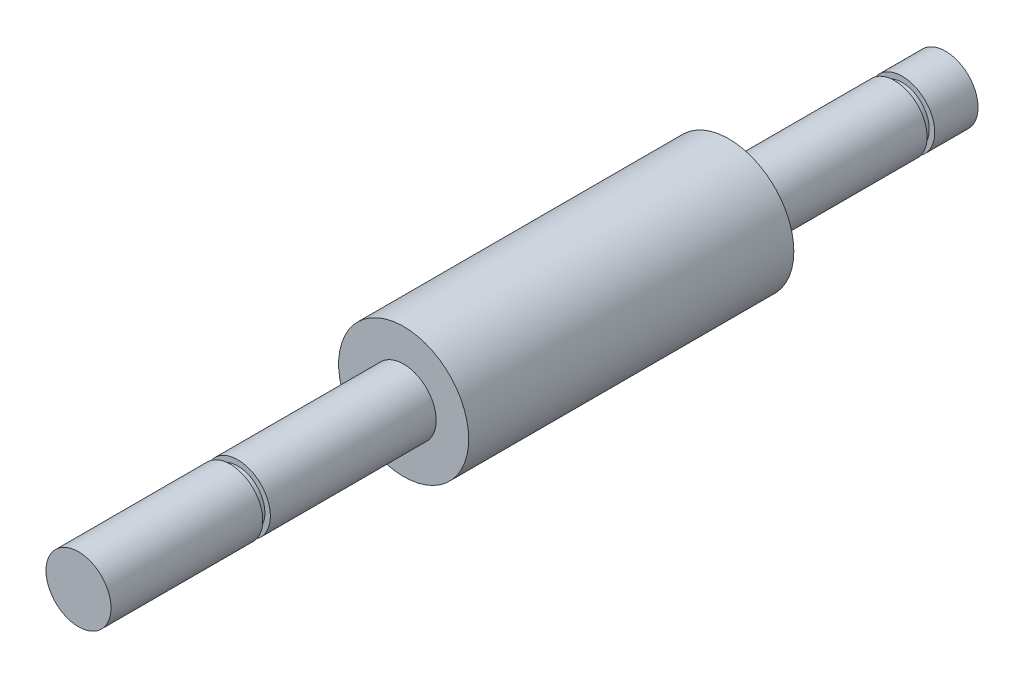
ISO-10303-21;
HEADER;
FILE_DESCRIPTION(('STEP AP214'),'2;1');
FILE_NAME('part.step','',(''),(''),'','','');
FILE_SCHEMA(('AUTOMOTIVE_DESIGN { 1 0 10303 214 1 1 1 1 }'));
ENDSEC;
DATA;
#1=APPLICATION_CONTEXT('core data for automotive mechanical design processes');
#2=APPLICATION_PROTOCOL_DEFINITION('international standard','automotive_design',2000,#1);
#3=PRODUCT_CONTEXT('',#1,'mechanical');
#4=PRODUCT('Part','Part','',(#3));
#5=PRODUCT_RELATED_PRODUCT_CATEGORY('part','',(#4));
#6=PRODUCT_DEFINITION_FORMATION('','',#4);
#7=PRODUCT_DEFINITION_CONTEXT('part definition',#1,'design');
#8=PRODUCT_DEFINITION('design','',#6,#7);
#9=PRODUCT_DEFINITION_SHAPE('','',#8);
#10=(LENGTH_UNIT() NAMED_UNIT(*) SI_UNIT(.MILLI.,.METRE.));
#11=(NAMED_UNIT(*) PLANE_ANGLE_UNIT() SI_UNIT($,.RADIAN.));
#12=(NAMED_UNIT(*) SI_UNIT($,.STERADIAN.) SOLID_ANGLE_UNIT());
#13=UNCERTAINTY_MEASURE_WITH_UNIT(LENGTH_MEASURE(1.E-05),#10,'distance_accuracy_value','');
#14=(GEOMETRIC_REPRESENTATION_CONTEXT(3) GLOBAL_UNCERTAINTY_ASSIGNED_CONTEXT((#13)) GLOBAL_UNIT_ASSIGNED_CONTEXT((#10,
#11,#12)) REPRESENTATION_CONTEXT('',''));
#15=CARTESIAN_POINT('',(0.,0.,0.));
#16=DIRECTION('',(0.,0.,1.));
#17=DIRECTION('',(1.,0.,0.));
#18=AXIS2_PLACEMENT_3D('',#15,#16,#17);
#19=CARTESIAN_POINT('',(0.,0.,-20.));
#20=DIRECTION('',(0.,0.,1.));
#21=DIRECTION('',(1.,0.,0.));
#22=AXIS2_PLACEMENT_3D('',#19,#20,#21);
#23=CYLINDRICAL_SURFACE('',#22,3.);
#24=CARTESIAN_POINT('',(0.,0.,0.));
#25=DIRECTION('',(0.,0.,1.));
#26=DIRECTION('',(1.,0.,0.));
#27=AXIS2_PLACEMENT_3D('',#24,#25,#26);
#28=CIRCLE('',#27,3.);
#29=CARTESIAN_POINT('',(3.,0.,0.));
#30=VERTEX_POINT('',#29);
#31=EDGE_CURVE('E10',#30,#30,#28,.F.);
#32=ORIENTED_EDGE('',*,*,#31,.T.);
#33=EDGE_LOOP('',(#32));
#34=FACE_BOUND('',#33,.T.);
#35=CARTESIAN_POINT('',(0.,0.,-15.3));
#36=DIRECTION('',(0.,0.,-1.));
#37=DIRECTION('',(-1.,0.,0.));
#38=AXIS2_PLACEMENT_3D('',#35,#36,#37);
#39=CIRCLE('',#38,3.);
#40=CARTESIAN_POINT('',(-3.,0.,-15.3));
#41=VERTEX_POINT('',#40);
#42=EDGE_CURVE('E51',#41,#41,#39,.T.);
#43=ORIENTED_EDGE('',*,*,#42,.F.);
#44=EDGE_LOOP('',(#43));
#45=FACE_BOUND('',#44,.T.);
#46=ADVANCED_FACE('F31',(#34,#45),#23,.T.);
#47=CARTESIAN_POINT('',(0.,0.,30.));
#48=DIRECTION('',(0.,0.,-1.));
#49=DIRECTION('',(-1.,0.,0.));
#50=AXIS2_PLACEMENT_3D('',#47,#48,#49);
#51=CYLINDRICAL_SURFACE('',#50,6.);
#52=CARTESIAN_POINT('',(0.,0.,30.));
#53=DIRECTION('',(0.,0.,1.));
#54=DIRECTION('',(1.,0.,0.));
#55=AXIS2_PLACEMENT_3D('',#52,#53,#54);
#56=CIRCLE('',#55,6.);
#57=CARTESIAN_POINT('',(6.,0.,30.));
#58=VERTEX_POINT('',#57);
#59=EDGE_CURVE('E39',#58,#58,#56,.T.);
#60=ORIENTED_EDGE('',*,*,#59,.F.);
#61=EDGE_LOOP('',(#60));
#62=FACE_BOUND('',#61,.T.);
#63=CARTESIAN_POINT('',(0.,0.,0.));
#64=DIRECTION('',(0.,0.,1.));
#65=DIRECTION('',(1.,0.,0.));
#66=AXIS2_PLACEMENT_3D('',#63,#64,#65);
#67=CIRCLE('',#66,6.);
#68=CARTESIAN_POINT('',(6.,0.,0.));
#69=VERTEX_POINT('',#68);
#70=EDGE_CURVE('E44',#69,#69,#67,.T.);
#71=ORIENTED_EDGE('',*,*,#70,.T.);
#72=EDGE_LOOP('',(#71));
#73=FACE_BOUND('',#72,.T.);
#74=ADVANCED_FACE('F33',(#62,#73),#51,.T.);
#75=CARTESIAN_POINT('',(0.,0.,30.));
#76=DIRECTION('',(0.,0.,1.));
#77=DIRECTION('',(1.,0.,0.));
#78=AXIS2_PLACEMENT_3D('',#75,#76,#77);
#79=PLANE('',#78);
#80=CARTESIAN_POINT('',(0.,0.,30.));
#81=DIRECTION('',(0.,0.,1.));
#82=DIRECTION('',(1.,0.,0.));
#83=AXIS2_PLACEMENT_3D('',#80,#81,#82);
#84=CIRCLE('',#83,3.);
#85=CARTESIAN_POINT('',(3.,0.,30.));
#86=VERTEX_POINT('',#85);
#87=EDGE_CURVE('E54',#86,#86,#84,.T.);
#88=ORIENTED_EDGE('',*,*,#87,.F.);
#89=EDGE_LOOP('',(#88));
#90=FACE_BOUND('',#89,.T.);
#91=ORIENTED_EDGE('',*,*,#59,.T.);
#92=EDGE_LOOP('',(#91));
#93=FACE_BOUND('',#92,.T.);
#94=ADVANCED_FACE('F90',(#90,#93),#79,.T.);
#95=CARTESIAN_POINT('',(0.,0.,0.));
#96=DIRECTION('',(0.,0.,1.));
#97=DIRECTION('',(1.,0.,0.));
#98=AXIS2_PLACEMENT_3D('',#95,#96,#97);
#99=PLANE('',#98);
#100=ORIENTED_EDGE('',*,*,#31,.F.);
#101=EDGE_LOOP('',(#100));
#102=FACE_BOUND('',#101,.T.);
#103=ORIENTED_EDGE('',*,*,#70,.F.);
#104=EDGE_LOOP('',(#103));
#105=FACE_BOUND('',#104,.T.);
#106=ADVANCED_FACE('F87',(#102,#105),#99,.F.);
#107=CARTESIAN_POINT('',(0.,0.,60.));
#108=DIRECTION('',(0.,0.,-1.));
#109=DIRECTION('',(-1.,0.,0.));
#110=AXIS2_PLACEMENT_3D('',#107,#108,#109);
#111=CYLINDRICAL_SURFACE('',#110,3.);
#112=CARTESIAN_POINT('',(0.,0.,45.3));
#113=DIRECTION('',(0.,0.,-1.));
#114=DIRECTION('',(-1.,0.,0.));
#115=AXIS2_PLACEMENT_3D('',#112,#113,#114);
#116=CIRCLE('',#115,3.);
#117=CARTESIAN_POINT('',(-3.,0.,45.3));
#118=VERTEX_POINT('',#117);
#119=EDGE_CURVE('E55',#118,#118,#116,.T.);
#120=ORIENTED_EDGE('',*,*,#119,.T.);
#121=EDGE_LOOP('',(#120));
#122=FACE_BOUND('',#121,.T.);
#123=ORIENTED_EDGE('',*,*,#87,.T.);
#124=EDGE_LOOP('',(#123));
#125=FACE_BOUND('',#124,.T.);
#126=ADVANCED_FACE('F89',(#122,#125),#111,.T.);
#127=CARTESIAN_POINT('',(0.,0.,-15.3));
#128=DIRECTION('',(0.,0.,-1.));
#129=DIRECTION('',(-1.,0.,0.));
#130=AXIS2_PLACEMENT_3D('',#127,#128,#129);
#131=PLANE('',#130);
#132=CARTESIAN_POINT('',(0.,0.,-15.3));
#133=DIRECTION('',(0.,0.,-1.));
#134=DIRECTION('',(-1.,0.,0.));
#135=AXIS2_PLACEMENT_3D('',#132,#133,#134);
#136=CIRCLE('',#135,2.5);
#137=CARTESIAN_POINT('',(-2.5,0.,-15.3));
#138=VERTEX_POINT('',#137);
#139=EDGE_CURVE('E52',#138,#138,#136,.T.);
#140=ORIENTED_EDGE('',*,*,#139,.F.);
#141=EDGE_LOOP('',(#140));
#142=FACE_BOUND('',#141,.T.);
#143=ORIENTED_EDGE('',*,*,#42,.T.);
#144=EDGE_LOOP('',(#143));
#145=FACE_BOUND('',#144,.T.);
#146=ADVANCED_FACE('F96',(#142,#145),#131,.T.);
#147=CARTESIAN_POINT('',(0.,0.,-16.));
#148=DIRECTION('',(0.,0.,-1.));
#149=DIRECTION('',(-1.,0.,0.));
#150=AXIS2_PLACEMENT_3D('',#147,#148,#149);
#151=PLANE('',#150);
#152=CARTESIAN_POINT('',(0.,0.,-16.));
#153=DIRECTION('',(0.,0.,-1.));
#154=DIRECTION('',(-1.,0.,0.));
#155=AXIS2_PLACEMENT_3D('',#152,#153,#154);
#156=CIRCLE('',#155,2.5);
#157=CARTESIAN_POINT('',(-2.5,0.,-16.));
#158=VERTEX_POINT('',#157);
#159=EDGE_CURVE('E61',#158,#158,#156,.T.);
#160=ORIENTED_EDGE('',*,*,#159,.T.);
#161=EDGE_LOOP('',(#160));
#162=FACE_BOUND('',#161,.T.);
#163=CARTESIAN_POINT('',(0.,0.,-16.));
#164=DIRECTION('',(0.,0.,-1.));
#165=DIRECTION('',(-1.,0.,0.));
#166=AXIS2_PLACEMENT_3D('',#163,#164,#165);
#167=CIRCLE('',#166,3.);
#168=CARTESIAN_POINT('',(-3.,0.,-16.));
#169=VERTEX_POINT('',#168);
#170=EDGE_CURVE('E48',#169,#169,#167,.T.);
#171=ORIENTED_EDGE('',*,*,#170,.F.);
#172=EDGE_LOOP('',(#171));
#173=FACE_BOUND('',#172,.T.);
#174=ADVANCED_FACE('F125',(#162,#173),#151,.F.);
#175=CARTESIAN_POINT('',(0.,0.,-15.3));
#176=DIRECTION('',(0.,0.,-1.));
#177=DIRECTION('',(-1.,0.,0.));
#178=AXIS2_PLACEMENT_3D('',#175,#176,#177);
#179=CYLINDRICAL_SURFACE('',#178,2.5);
#180=ORIENTED_EDGE('',*,*,#139,.T.);
#181=EDGE_LOOP('',(#180));
#182=FACE_BOUND('',#181,.T.);
#183=ORIENTED_EDGE('',*,*,#159,.F.);
#184=EDGE_LOOP('',(#183));
#185=FACE_BOUND('',#184,.T.);
#186=ADVANCED_FACE('F121',(#182,#185),#179,.T.);
#187=CARTESIAN_POINT('',(0.,0.,-20.));
#188=DIRECTION('',(0.,0.,-1.));
#189=DIRECTION('',(-1.,0.,0.));
#190=AXIS2_PLACEMENT_3D('',#187,#188,#189);
#191=PLANE('',#190);
#192=CARTESIAN_POINT('',(0.,0.,-20.));
#193=DIRECTION('',(0.,0.,-1.));
#194=DIRECTION('',(-1.,0.,0.));
#195=AXIS2_PLACEMENT_3D('',#192,#193,#194);
#196=CIRCLE('',#195,3.);
#197=CARTESIAN_POINT('',(-3.,0.,-20.));
#198=VERTEX_POINT('',#197);
#199=EDGE_CURVE('E77',#198,#198,#196,.T.);
#200=ORIENTED_EDGE('',*,*,#199,.T.);
#201=EDGE_LOOP('',(#200));
#202=FACE_BOUND('',#201,.T.);
#203=ADVANCED_FACE('F112',(#202),#191,.T.);
#204=ORIENTED_EDGE('',*,*,#170,.T.);
#205=EDGE_LOOP('',(#204));
#206=FACE_BOUND('',#205,.T.);
#207=ORIENTED_EDGE('',*,*,#199,.F.);
#208=EDGE_LOOP('',(#207));
#209=FACE_BOUND('',#208,.T.);
#210=ADVANCED_FACE('F103',(#206,#209),#23,.T.);
#211=CARTESIAN_POINT('',(0.,0.,46.));
#212=DIRECTION('',(0.,0.,-1.));
#213=DIRECTION('',(-1.,0.,0.));
#214=AXIS2_PLACEMENT_3D('',#211,#212,#213);
#215=PLANE('',#214);
#216=CARTESIAN_POINT('',(0.,0.,46.));
#217=DIRECTION('',(0.,0.,-1.));
#218=DIRECTION('',(-1.,0.,0.));
#219=AXIS2_PLACEMENT_3D('',#216,#217,#218);
#220=CIRCLE('',#219,2.5);
#221=CARTESIAN_POINT('',(-2.5,0.,46.));
#222=VERTEX_POINT('',#221);
#223=EDGE_CURVE('E57',#222,#222,#220,.T.);
#224=ORIENTED_EDGE('',*,*,#223,.F.);
#225=EDGE_LOOP('',(#224));
#226=FACE_BOUND('',#225,.T.);
#227=CARTESIAN_POINT('',(0.,0.,46.));
#228=DIRECTION('',(0.,0.,-1.));
#229=DIRECTION('',(-1.,0.,0.));
#230=AXIS2_PLACEMENT_3D('',#227,#228,#229);
#231=CIRCLE('',#230,3.);
#232=CARTESIAN_POINT('',(-3.,0.,46.));
#233=VERTEX_POINT('',#232);
#234=EDGE_CURVE('E35',#233,#233,#231,.T.);
#235=ORIENTED_EDGE('',*,*,#234,.T.);
#236=EDGE_LOOP('',(#235));
#237=FACE_BOUND('',#236,.T.);
#238=ADVANCED_FACE('F111',(#226,#237),#215,.T.);
#239=CARTESIAN_POINT('',(0.,0.,45.3));
#240=DIRECTION('',(0.,0.,-1.));
#241=DIRECTION('',(-1.,0.,0.));
#242=AXIS2_PLACEMENT_3D('',#239,#240,#241);
#243=PLANE('',#242);
#244=CARTESIAN_POINT('',(0.,0.,45.3));
#245=DIRECTION('',(0.,0.,-1.));
#246=DIRECTION('',(-1.,0.,0.));
#247=AXIS2_PLACEMENT_3D('',#244,#245,#246);
#248=CIRCLE('',#247,2.5);
#249=CARTESIAN_POINT('',(-2.5,0.,45.3));
#250=VERTEX_POINT('',#249);
#251=EDGE_CURVE('E63',#250,#250,#248,.T.);
#252=ORIENTED_EDGE('',*,*,#251,.T.);
#253=EDGE_LOOP('',(#252));
#254=FACE_BOUND('',#253,.T.);
#255=ORIENTED_EDGE('',*,*,#119,.F.);
#256=EDGE_LOOP('',(#255));
#257=FACE_BOUND('',#256,.T.);
#258=ADVANCED_FACE('F118',(#254,#257),#243,.F.);
#259=CARTESIAN_POINT('',(0.,0.,46.));
#260=DIRECTION('',(0.,0.,-1.));
#261=DIRECTION('',(-1.,0.,0.));
#262=AXIS2_PLACEMENT_3D('',#259,#260,#261);
#263=CYLINDRICAL_SURFACE('',#262,2.5);
#264=ORIENTED_EDGE('',*,*,#223,.T.);
#265=EDGE_LOOP('',(#264));
#266=FACE_BOUND('',#265,.T.);
#267=ORIENTED_EDGE('',*,*,#251,.F.);
#268=EDGE_LOOP('',(#267));
#269=FACE_BOUND('',#268,.T.);
#270=ADVANCED_FACE('F140',(#266,#269),#263,.T.);
#271=CARTESIAN_POINT('',(0.,0.,60.));
#272=DIRECTION('',(0.,0.,1.));
#273=DIRECTION('',(1.,0.,0.));
#274=AXIS2_PLACEMENT_3D('',#271,#272,#273);
#275=PLANE('',#274);
#276=CARTESIAN_POINT('',(0.,0.,60.));
#277=DIRECTION('',(0.,0.,1.));
#278=DIRECTION('',(1.,0.,0.));
#279=AXIS2_PLACEMENT_3D('',#276,#277,#278);
#280=CIRCLE('',#279,3.);
#281=CARTESIAN_POINT('',(3.,0.,60.));
#282=VERTEX_POINT('',#281);
#283=EDGE_CURVE('E74',#282,#282,#280,.T.);
#284=ORIENTED_EDGE('',*,*,#283,.T.);
#285=EDGE_LOOP('',(#284));
#286=FACE_BOUND('',#285,.T.);
#287=ADVANCED_FACE('F138',(#286),#275,.T.);
#288=ORIENTED_EDGE('',*,*,#283,.F.);
#289=EDGE_LOOP('',(#288));
#290=FACE_BOUND('',#289,.T.);
#291=ORIENTED_EDGE('',*,*,#234,.F.);
#292=EDGE_LOOP('',(#291));
#293=FACE_BOUND('',#292,.T.);
#294=ADVANCED_FACE('F98',(#290,#293),#111,.T.);
#295=CLOSED_SHELL('',(#46,#74,#94,#106,#126,#146,#174,#186,#203,#210,#238,#258,#270,#287,#294));
#296=MANIFOLD_SOLID_BREP('B2',#295);
#297=ADVANCED_BREP_SHAPE_REPRESENTATION('',(#18,#296),#14);
#298=SHAPE_DEFINITION_REPRESENTATION(#9,#297);
ENDSEC;
END-ISO-10303-21;
